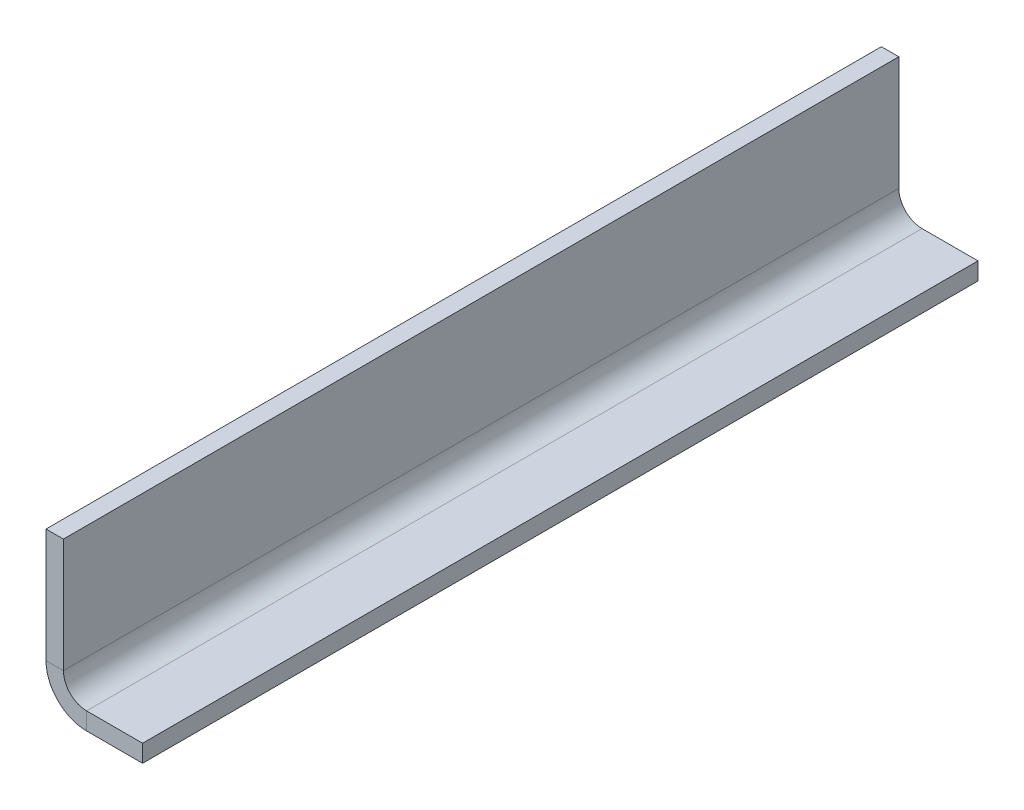
ISO-10303-21;
HEADER;
FILE_DESCRIPTION(('STEP AP214'),'2;1');
FILE_NAME('part.step','',(''),(''),'','','');
FILE_SCHEMA(('AUTOMOTIVE_DESIGN { 1 0 10303 214 1 1 1 1 }'));
ENDSEC;
DATA;
#1=APPLICATION_CONTEXT('core data for automotive mechanical design processes');
#2=APPLICATION_PROTOCOL_DEFINITION('international standard','automotive_design',2000,#1);
#3=PRODUCT_CONTEXT('',#1,'mechanical');
#4=PRODUCT('Part','Part','',(#3));
#5=PRODUCT_RELATED_PRODUCT_CATEGORY('part','',(#4));
#6=PRODUCT_DEFINITION_FORMATION('','',#4);
#7=PRODUCT_DEFINITION_CONTEXT('part definition',#1,'design');
#8=PRODUCT_DEFINITION('design','',#6,#7);
#9=PRODUCT_DEFINITION_SHAPE('','',#8);
#10=(LENGTH_UNIT() NAMED_UNIT(*) SI_UNIT(.MILLI.,.METRE.));
#11=(NAMED_UNIT(*) PLANE_ANGLE_UNIT() SI_UNIT($,.RADIAN.));
#12=(NAMED_UNIT(*) SI_UNIT($,.STERADIAN.) SOLID_ANGLE_UNIT());
#13=UNCERTAINTY_MEASURE_WITH_UNIT(LENGTH_MEASURE(1.E-05),#10,'distance_accuracy_value','');
#14=(GEOMETRIC_REPRESENTATION_CONTEXT(3) GLOBAL_UNCERTAINTY_ASSIGNED_CONTEXT((#13)) GLOBAL_UNIT_ASSIGNED_CONTEXT((#10,
#11,#12)) REPRESENTATION_CONTEXT('',''));
#15=CARTESIAN_POINT('',(0.,0.,0.));
#16=DIRECTION('',(0.,0.,1.));
#17=DIRECTION('',(1.,0.,0.));
#18=AXIS2_PLACEMENT_3D('',#15,#16,#17);
#19=CARTESIAN_POINT('',(3.175,3.175,0.));
#20=DIRECTION('',(0.,0.,1.));
#21=DIRECTION('',(0.,1.,0.));
#22=AXIS2_PLACEMENT_3D('',#19,#20,#21);
#23=PLANE('',#22);
#24=DIRECTION('',(1.,0.,0.));
#25=VECTOR('',#24,1.);
#26=CARTESIAN_POINT('',(3.175,5.175,0.));
#27=LINE('',#26,#25);
#28=CARTESIAN_POINT('',(1.675,5.175,0.));
#29=VERTEX_POINT('',#28);
#30=CARTESIAN_POINT('',(3.175,5.175,0.));
#31=VERTEX_POINT('',#30);
#32=EDGE_CURVE('E11',#29,#31,#27,.T.);
#33=ORIENTED_EDGE('',*,*,#32,.F.);
#34=DIRECTION('',(0.,-1.,0.));
#35=VECTOR('',#34,1.);
#36=CARTESIAN_POINT('',(1.675,3.175,0.));
#37=LINE('',#36,#35);
#38=CARTESIAN_POINT('',(1.675,15.,0.));
#39=VERTEX_POINT('',#38);
#40=EDGE_CURVE('E93',#29,#39,#37,.F.);
#41=ORIENTED_EDGE('',*,*,#40,.T.);
#42=DIRECTION('',(1.,0.,0.));
#43=VECTOR('',#42,1.);
#44=CARTESIAN_POINT('',(3.175,15.,0.));
#45=LINE('',#44,#43);
#46=CARTESIAN_POINT('',(3.175,15.,0.));
#47=VERTEX_POINT('',#46);
#48=EDGE_CURVE('E53',#39,#47,#45,.T.);
#49=ORIENTED_EDGE('',*,*,#48,.T.);
#50=DIRECTION('',(0.,1.,0.));
#51=VECTOR('',#50,1.);
#52=CARTESIAN_POINT('',(3.175,3.175,0.));
#53=LINE('',#52,#51);
#54=EDGE_CURVE('E96',#31,#47,#53,.T.);
#55=ORIENTED_EDGE('',*,*,#54,.F.);
#56=EDGE_LOOP('',(#33,#41,#49,#55));
#57=FACE_BOUND('',#56,.T.);
#58=ADVANCED_FACE('F43',(#57),#23,.F.);
#59=CARTESIAN_POINT('',(3.175,15.,72.));
#60=DIRECTION('',(0.,1.,0.));
#61=DIRECTION('',(0.,0.,-1.));
#62=AXIS2_PLACEMENT_3D('',#59,#60,#61);
#63=PLANE('',#62);
#64=ORIENTED_EDGE('',*,*,#48,.F.);
#65=DIRECTION('',(0.,0.,1.));
#66=VECTOR('',#65,1.);
#67=CARTESIAN_POINT('',(1.675,15.,72.));
#68=LINE('',#67,#66);
#69=CARTESIAN_POINT('',(1.675,15.,72.));
#70=VERTEX_POINT('',#69);
#71=EDGE_CURVE('E121',#70,#39,#68,.F.);
#72=ORIENTED_EDGE('',*,*,#71,.F.);
#73=DIRECTION('',(1.,0.,0.));
#74=VECTOR('',#73,1.);
#75=CARTESIAN_POINT('',(3.175,15.,72.));
#76=LINE('',#75,#74);
#77=CARTESIAN_POINT('',(3.175,15.,72.));
#78=VERTEX_POINT('',#77);
#79=EDGE_CURVE('E139',#70,#78,#76,.T.);
#80=ORIENTED_EDGE('',*,*,#79,.T.);
#81=DIRECTION('',(0.,0.,-1.));
#82=VECTOR('',#81,1.);
#83=CARTESIAN_POINT('',(3.175,15.,72.));
#84=LINE('',#83,#82);
#85=EDGE_CURVE('E150',#78,#47,#84,.T.);
#86=ORIENTED_EDGE('',*,*,#85,.T.);
#87=EDGE_LOOP('',(#64,#72,#80,#86));
#88=FACE_BOUND('',#87,.T.);
#89=ADVANCED_FACE('F156',(#88),#63,.T.);
#90=CARTESIAN_POINT('',(3.175,3.175,72.));
#91=DIRECTION('',(0.,0.,1.));
#92=DIRECTION('',(0.,1.,0.));
#93=AXIS2_PLACEMENT_3D('',#90,#91,#92);
#94=PLANE('',#93);
#95=ORIENTED_EDGE('',*,*,#79,.F.);
#96=DIRECTION('',(0.,-1.,0.));
#97=VECTOR('',#96,1.);
#98=CARTESIAN_POINT('',(1.675,3.175,72.));
#99=LINE('',#98,#97);
#100=CARTESIAN_POINT('',(1.675,5.175,72.));
#101=VERTEX_POINT('',#100);
#102=EDGE_CURVE('E181',#101,#70,#99,.F.);
#103=ORIENTED_EDGE('',*,*,#102,.F.);
#104=DIRECTION('',(1.,0.,0.));
#105=VECTOR('',#104,1.);
#106=CARTESIAN_POINT('',(3.175,5.175,72.));
#107=LINE('',#106,#105);
#108=CARTESIAN_POINT('',(3.175,5.175,72.));
#109=VERTEX_POINT('',#108);
#110=EDGE_CURVE('E136',#101,#109,#107,.T.);
#111=ORIENTED_EDGE('',*,*,#110,.T.);
#112=DIRECTION('',(0.,1.,0.));
#113=VECTOR('',#112,1.);
#114=CARTESIAN_POINT('',(3.175,3.175,72.));
#115=LINE('',#114,#113);
#116=EDGE_CURVE('E157',#109,#78,#115,.T.);
#117=ORIENTED_EDGE('',*,*,#116,.T.);
#118=EDGE_LOOP('',(#95,#103,#111,#117));
#119=FACE_BOUND('',#118,.T.);
#120=ADVANCED_FACE('F187',(#119),#94,.T.);
#121=CARTESIAN_POINT('',(5.175,5.175,72.));
#122=DIRECTION('',(0.,0.,1.));
#123=DIRECTION('',(1.,0.,0.));
#124=AXIS2_PLACEMENT_3D('',#121,#122,#123);
#125=PLANE('',#124);
#126=ORIENTED_EDGE('',*,*,#110,.F.);
#127=CARTESIAN_POINT('',(5.175,5.175,72.));
#128=DIRECTION('',(0.,0.,1.));
#129=DIRECTION('',(1.,0.,0.));
#130=AXIS2_PLACEMENT_3D('',#127,#128,#129);
#131=CIRCLE('',#130,3.5);
#132=CARTESIAN_POINT('',(5.175,1.675,72.));
#133=VERTEX_POINT('',#132);
#134=EDGE_CURVE('E111',#101,#133,#131,.T.);
#135=ORIENTED_EDGE('',*,*,#134,.T.);
#136=DIRECTION('',(0.,1.,0.));
#137=VECTOR('',#136,1.);
#138=CARTESIAN_POINT('',(5.175,3.175,72.));
#139=LINE('',#138,#137);
#140=CARTESIAN_POINT('',(5.175,3.175,72.));
#141=VERTEX_POINT('',#140);
#142=EDGE_CURVE('E61',#133,#141,#139,.T.);
#143=ORIENTED_EDGE('',*,*,#142,.T.);
#144=CARTESIAN_POINT('',(5.175,5.175,72.));
#145=DIRECTION('',(0.,0.,-1.));
#146=DIRECTION('',(-1.,0.,0.));
#147=AXIS2_PLACEMENT_3D('',#144,#145,#146);
#148=CIRCLE('',#147,2.);
#149=EDGE_CURVE('E154',#109,#141,#148,.F.);
#150=ORIENTED_EDGE('',*,*,#149,.F.);
#151=EDGE_LOOP('',(#126,#135,#143,#150));
#152=FACE_BOUND('',#151,.T.);
#153=ADVANCED_FACE('F190',(#152),#125,.T.);
#154=CARTESIAN_POINT('',(10.,3.175,72.));
#155=DIRECTION('',(0.,0.,1.));
#156=DIRECTION('',(-1.,0.,0.));
#157=AXIS2_PLACEMENT_3D('',#154,#155,#156);
#158=PLANE('',#157);
#159=ORIENTED_EDGE('',*,*,#142,.F.);
#160=DIRECTION('',(1.,0.,0.));
#161=VECTOR('',#160,1.);
#162=CARTESIAN_POINT('',(10.,1.675,72.));
#163=LINE('',#162,#161);
#164=CARTESIAN_POINT('',(10.,1.675,72.));
#165=VERTEX_POINT('',#164);
#166=EDGE_CURVE('E180',#165,#133,#163,.F.);
#167=ORIENTED_EDGE('',*,*,#166,.F.);
#168=DIRECTION('',(0.,1.,0.));
#169=VECTOR('',#168,1.);
#170=CARTESIAN_POINT('',(10.,3.175,72.));
#171=LINE('',#170,#169);
#172=CARTESIAN_POINT('',(10.,3.175,72.));
#173=VERTEX_POINT('',#172);
#174=EDGE_CURVE('E132',#165,#173,#171,.T.);
#175=ORIENTED_EDGE('',*,*,#174,.T.);
#176=DIRECTION('',(-1.,0.,0.));
#177=VECTOR('',#176,1.);
#178=CARTESIAN_POINT('',(10.,3.175,72.));
#179=LINE('',#178,#177);
#180=EDGE_CURVE('E164',#173,#141,#179,.T.);
#181=ORIENTED_EDGE('',*,*,#180,.T.);
#182=EDGE_LOOP('',(#159,#167,#175,#181));
#183=FACE_BOUND('',#182,.T.);
#184=ADVANCED_FACE('F201',(#183),#158,.T.);
#185=CARTESIAN_POINT('',(10.,3.175,72.));
#186=DIRECTION('',(-1.,0.,0.));
#187=DIRECTION('',(0.,0.,-1.));
#188=AXIS2_PLACEMENT_3D('',#185,#186,#187);
#189=PLANE('',#188);
#190=ORIENTED_EDGE('',*,*,#174,.F.);
#191=DIRECTION('',(0.,0.,1.));
#192=VECTOR('',#191,1.);
#193=CARTESIAN_POINT('',(10.,1.675,72.));
#194=LINE('',#193,#192);
#195=CARTESIAN_POINT('',(10.,1.675,0.));
#196=VERTEX_POINT('',#195);
#197=EDGE_CURVE('E116',#165,#196,#194,.F.);
#198=ORIENTED_EDGE('',*,*,#197,.T.);
#199=DIRECTION('',(0.,1.,0.));
#200=VECTOR('',#199,1.);
#201=CARTESIAN_POINT('',(10.,3.175,0.));
#202=LINE('',#201,#200);
#203=CARTESIAN_POINT('',(10.,3.175,0.));
#204=VERTEX_POINT('',#203);
#205=EDGE_CURVE('E129',#196,#204,#202,.T.);
#206=ORIENTED_EDGE('',*,*,#205,.T.);
#207=DIRECTION('',(0.,0.,-1.));
#208=VECTOR('',#207,1.);
#209=CARTESIAN_POINT('',(10.,3.175,72.));
#210=LINE('',#209,#208);
#211=EDGE_CURVE('E167',#173,#204,#210,.T.);
#212=ORIENTED_EDGE('',*,*,#211,.F.);
#213=EDGE_LOOP('',(#190,#198,#206,#212));
#214=FACE_BOUND('',#213,.T.);
#215=ADVANCED_FACE('F207',(#214),#189,.F.);
#216=CARTESIAN_POINT('',(10.,3.175,0.));
#217=DIRECTION('',(0.,0.,1.));
#218=DIRECTION('',(-1.,0.,0.));
#219=AXIS2_PLACEMENT_3D('',#216,#217,#218);
#220=PLANE('',#219);
#221=ORIENTED_EDGE('',*,*,#205,.F.);
#222=DIRECTION('',(1.,0.,0.));
#223=VECTOR('',#222,1.);
#224=CARTESIAN_POINT('',(10.,1.675,0.));
#225=LINE('',#224,#223);
#226=CARTESIAN_POINT('',(5.175,1.675,0.));
#227=VERTEX_POINT('',#226);
#228=EDGE_CURVE('E178',#196,#227,#225,.F.);
#229=ORIENTED_EDGE('',*,*,#228,.T.);
#230=DIRECTION('',(0.,1.,0.));
#231=VECTOR('',#230,1.);
#232=CARTESIAN_POINT('',(5.175,3.175,0.));
#233=LINE('',#232,#231);
#234=CARTESIAN_POINT('',(5.175,3.175,0.));
#235=VERTEX_POINT('',#234);
#236=EDGE_CURVE('E47',#227,#235,#233,.T.);
#237=ORIENTED_EDGE('',*,*,#236,.T.);
#238=DIRECTION('',(-1.,0.,0.));
#239=VECTOR('',#238,1.);
#240=CARTESIAN_POINT('',(10.,3.175,0.));
#241=LINE('',#240,#239);
#242=EDGE_CURVE('E159',#204,#235,#241,.T.);
#243=ORIENTED_EDGE('',*,*,#242,.F.);
#244=EDGE_LOOP('',(#221,#229,#237,#243));
#245=FACE_BOUND('',#244,.T.);
#246=ADVANCED_FACE('F211',(#245),#220,.F.);
#247=CARTESIAN_POINT('',(5.175,5.175,0.));
#248=DIRECTION('',(0.,0.,-1.));
#249=DIRECTION('',(-1.,0.,0.));
#250=AXIS2_PLACEMENT_3D('',#247,#248,#249);
#251=PLANE('',#250);
#252=CARTESIAN_POINT('',(5.175,5.175,0.));
#253=DIRECTION('',(0.,0.,1.));
#254=DIRECTION('',(1.,0.,0.));
#255=AXIS2_PLACEMENT_3D('',#252,#253,#254);
#256=CIRCLE('',#255,3.5);
#257=EDGE_CURVE('E109',#227,#29,#256,.F.);
#258=ORIENTED_EDGE('',*,*,#257,.T.);
#259=ORIENTED_EDGE('',*,*,#32,.T.);
#260=CARTESIAN_POINT('',(5.175,5.175,0.));
#261=DIRECTION('',(0.,0.,1.));
#262=DIRECTION('',(1.,0.,0.));
#263=AXIS2_PLACEMENT_3D('',#260,#261,#262);
#264=CIRCLE('',#263,2.);
#265=EDGE_CURVE('E174',#235,#31,#264,.F.);
#266=ORIENTED_EDGE('',*,*,#265,.F.);
#267=ORIENTED_EDGE('',*,*,#236,.F.);
#268=EDGE_LOOP('',(#258,#259,#266,#267));
#269=FACE_BOUND('',#268,.T.);
#270=ADVANCED_FACE('F45',(#269),#251,.T.);
#271=CARTESIAN_POINT('',(10.,3.175,72.));
#272=DIRECTION('',(0.,-1.,0.));
#273=DIRECTION('',(1.,0.,0.));
#274=AXIS2_PLACEMENT_3D('',#271,#272,#273);
#275=PLANE('',#274);
#276=ORIENTED_EDGE('',*,*,#242,.T.);
#277=DIRECTION('',(0.,0.,-1.));
#278=VECTOR('',#277,1.);
#279=CARTESIAN_POINT('',(5.175,3.175,72.));
#280=LINE('',#279,#278);
#281=EDGE_CURVE('E171',#235,#141,#280,.F.);
#282=ORIENTED_EDGE('',*,*,#281,.T.);
#283=ORIENTED_EDGE('',*,*,#180,.F.);
#284=ORIENTED_EDGE('',*,*,#211,.T.);
#285=EDGE_LOOP('',(#276,#282,#283,#284));
#286=FACE_BOUND('',#285,.T.);
#287=ADVANCED_FACE('F206',(#286),#275,.F.);
#288=CARTESIAN_POINT('',(3.175,3.175,72.));
#289=DIRECTION('',(-1.,0.,0.));
#290=DIRECTION('',(0.,-1.,0.));
#291=AXIS2_PLACEMENT_3D('',#288,#289,#290);
#292=PLANE('',#291);
#293=ORIENTED_EDGE('',*,*,#116,.F.);
#294=DIRECTION('',(0.,0.,-1.));
#295=VECTOR('',#294,1.);
#296=CARTESIAN_POINT('',(3.175,5.175,0.));
#297=LINE('',#296,#295);
#298=EDGE_CURVE('E153',#109,#31,#297,.T.);
#299=ORIENTED_EDGE('',*,*,#298,.T.);
#300=ORIENTED_EDGE('',*,*,#54,.T.);
#301=ORIENTED_EDGE('',*,*,#85,.F.);
#302=EDGE_LOOP('',(#293,#299,#300,#301));
#303=FACE_BOUND('',#302,.T.);
#304=ADVANCED_FACE('F149',(#303),#292,.F.);
#305=CARTESIAN_POINT('',(5.175,5.175,72.));
#306=DIRECTION('',(0.,0.,1.));
#307=DIRECTION('',(1.,0.,0.));
#308=AXIS2_PLACEMENT_3D('',#305,#306,#307);
#309=CYLINDRICAL_SURFACE('',#308,2.);
#310=ORIENTED_EDGE('',*,*,#149,.T.);
#311=ORIENTED_EDGE('',*,*,#281,.F.);
#312=ORIENTED_EDGE('',*,*,#265,.T.);
#313=ORIENTED_EDGE('',*,*,#298,.F.);
#314=EDGE_LOOP('',(#310,#311,#312,#313));
#315=FACE_BOUND('',#314,.T.);
#316=ADVANCED_FACE('F193',(#315),#309,.F.);
#317=CARTESIAN_POINT('',(10.,1.675,72.));
#318=DIRECTION('',(0.,-1.,0.));
#319=DIRECTION('',(1.,0.,0.));
#320=AXIS2_PLACEMENT_3D('',#317,#318,#319);
#321=PLANE('',#320);
#322=ORIENTED_EDGE('',*,*,#228,.F.);
#323=ORIENTED_EDGE('',*,*,#197,.F.);
#324=ORIENTED_EDGE('',*,*,#166,.T.);
#325=DIRECTION('',(0.,0.,1.));
#326=VECTOR('',#325,1.);
#327=CARTESIAN_POINT('',(5.175,1.675,72.));
#328=LINE('',#327,#326);
#329=EDGE_CURVE('E115',#227,#133,#328,.T.);
#330=ORIENTED_EDGE('',*,*,#329,.F.);
#331=EDGE_LOOP('',(#322,#323,#324,#330));
#332=FACE_BOUND('',#331,.T.);
#333=ADVANCED_FACE('F213',(#332),#321,.T.);
#334=CARTESIAN_POINT('',(1.675,3.175,72.));
#335=DIRECTION('',(-1.,0.,0.));
#336=DIRECTION('',(0.,-1.,0.));
#337=AXIS2_PLACEMENT_3D('',#334,#335,#336);
#338=PLANE('',#337);
#339=ORIENTED_EDGE('',*,*,#102,.T.);
#340=ORIENTED_EDGE('',*,*,#71,.T.);
#341=ORIENTED_EDGE('',*,*,#40,.F.);
#342=DIRECTION('',(0.,0.,1.));
#343=VECTOR('',#342,1.);
#344=CARTESIAN_POINT('',(1.675,5.175,72.));
#345=LINE('',#344,#343);
#346=EDGE_CURVE('E106',#101,#29,#345,.F.);
#347=ORIENTED_EDGE('',*,*,#346,.F.);
#348=EDGE_LOOP('',(#339,#340,#341,#347));
#349=FACE_BOUND('',#348,.T.);
#350=ADVANCED_FACE('F119',(#349),#338,.T.);
#351=CARTESIAN_POINT('',(5.175,5.175,72.));
#352=DIRECTION('',(0.,0.,1.));
#353=DIRECTION('',(1.,0.,0.));
#354=AXIS2_PLACEMENT_3D('',#351,#352,#353);
#355=CYLINDRICAL_SURFACE('',#354,3.5);
#356=ORIENTED_EDGE('',*,*,#134,.F.);
#357=ORIENTED_EDGE('',*,*,#346,.T.);
#358=ORIENTED_EDGE('',*,*,#257,.F.);
#359=ORIENTED_EDGE('',*,*,#329,.T.);
#360=EDGE_LOOP('',(#356,#357,#358,#359));
#361=FACE_BOUND('',#360,.T.);
#362=ADVANCED_FACE('F107',(#361),#355,.T.);
#363=CLOSED_SHELL('',(#58,#89,#120,#153,#184,#215,#246,#270,#287,#304,#316,#333,#350,#362));
#364=MANIFOLD_SOLID_BREP('B2',#363);
#365=ADVANCED_BREP_SHAPE_REPRESENTATION('',(#18,#364),#14);
#366=SHAPE_DEFINITION_REPRESENTATION(#9,#365);
ENDSEC;
END-ISO-10303-21;
